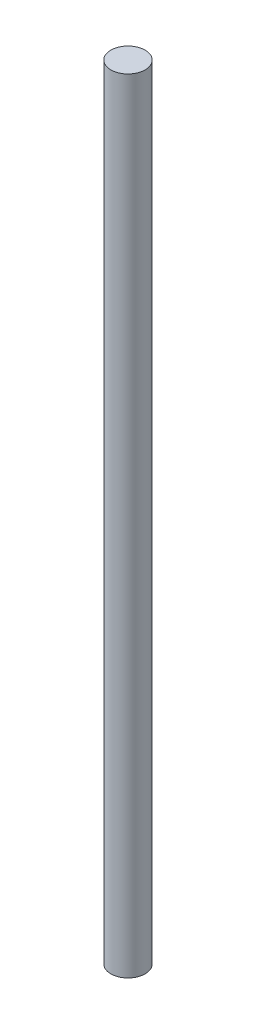
ISO-10303-21;
HEADER;
FILE_DESCRIPTION(('STEP AP214'),'2;1');
FILE_NAME('part.step','',(''),(''),'','','');
FILE_SCHEMA(('AUTOMOTIVE_DESIGN { 1 0 10303 214 1 1 1 1 }'));
ENDSEC;
DATA;
#1=APPLICATION_CONTEXT('core data for automotive mechanical design processes');
#2=APPLICATION_PROTOCOL_DEFINITION('international standard','automotive_design',2000,#1);
#3=PRODUCT_CONTEXT('',#1,'mechanical');
#4=PRODUCT('Part','Part','',(#3));
#5=PRODUCT_RELATED_PRODUCT_CATEGORY('part','',(#4));
#6=PRODUCT_DEFINITION_FORMATION('','',#4);
#7=PRODUCT_DEFINITION_CONTEXT('part definition',#1,'design');
#8=PRODUCT_DEFINITION('design','',#6,#7);
#9=PRODUCT_DEFINITION_SHAPE('','',#8);
#10=(LENGTH_UNIT() NAMED_UNIT(*) SI_UNIT(.MILLI.,.METRE.));
#11=(NAMED_UNIT(*) PLANE_ANGLE_UNIT() SI_UNIT($,.RADIAN.));
#12=(NAMED_UNIT(*) SI_UNIT($,.STERADIAN.) SOLID_ANGLE_UNIT());
#13=UNCERTAINTY_MEASURE_WITH_UNIT(LENGTH_MEASURE(1.E-05),#10,'distance_accuracy_value','');
#14=(GEOMETRIC_REPRESENTATION_CONTEXT(3) GLOBAL_UNCERTAINTY_ASSIGNED_CONTEXT((#13)) GLOBAL_UNIT_ASSIGNED_CONTEXT((#10,
#11,#12)) REPRESENTATION_CONTEXT('',''));
#15=CARTESIAN_POINT('',(0.,0.,0.));
#16=DIRECTION('',(0.,0.,1.));
#17=DIRECTION('',(1.,0.,0.));
#18=AXIS2_PLACEMENT_3D('',#15,#16,#17);
#19=CARTESIAN_POINT('',(0.,457.,0.));
#20=DIRECTION('',(0.,-1.,0.));
#21=DIRECTION('',(0.,0.,-1.));
#22=AXIS2_PLACEMENT_3D('',#19,#20,#21);
#23=CYLINDRICAL_SURFACE('',#22,10.);
#24=CARTESIAN_POINT('',(0.,457.,0.));
#25=DIRECTION('',(0.,1.,0.));
#26=DIRECTION('',(0.,0.,1.));
#27=AXIS2_PLACEMENT_3D('',#24,#25,#26);
#28=CIRCLE('',#27,10.);
#29=CARTESIAN_POINT('',(0.,457.,10.));
#30=VERTEX_POINT('',#29);
#31=EDGE_CURVE('E10',#30,#30,#28,.T.);
#32=ORIENTED_EDGE('',*,*,#31,.F.);
#33=EDGE_LOOP('',(#32));
#34=FACE_BOUND('',#33,.T.);
#35=CARTESIAN_POINT('',(0.,0.,0.));
#36=DIRECTION('',(0.,1.,0.));
#37=DIRECTION('',(0.,0.,1.));
#38=AXIS2_PLACEMENT_3D('',#35,#36,#37);
#39=CIRCLE('',#38,10.);
#40=CARTESIAN_POINT('',(0.,0.,10.));
#41=VERTEX_POINT('',#40);
#42=EDGE_CURVE('E38',#41,#41,#39,.T.);
#43=ORIENTED_EDGE('',*,*,#42,.T.);
#44=EDGE_LOOP('',(#43));
#45=FACE_BOUND('',#44,.T.);
#46=ADVANCED_FACE('F35',(#34,#45),#23,.T.);
#47=CARTESIAN_POINT('',(0.,457.,0.));
#48=DIRECTION('',(0.,1.,0.));
#49=DIRECTION('',(0.,0.,1.));
#50=AXIS2_PLACEMENT_3D('',#47,#48,#49);
#51=PLANE('',#50);
#52=ORIENTED_EDGE('',*,*,#31,.T.);
#53=EDGE_LOOP('',(#52));
#54=FACE_BOUND('',#53,.T.);
#55=ADVANCED_FACE('F50',(#54),#51,.T.);
#56=CARTESIAN_POINT('',(0.,0.,0.));
#57=DIRECTION('',(0.,1.,0.));
#58=DIRECTION('',(0.,0.,1.));
#59=AXIS2_PLACEMENT_3D('',#56,#57,#58);
#60=PLANE('',#59);
#61=ORIENTED_EDGE('',*,*,#42,.F.);
#62=EDGE_LOOP('',(#61));
#63=FACE_BOUND('',#62,.T.);
#64=ADVANCED_FACE('F48',(#63),#60,.F.);
#65=CLOSED_SHELL('',(#46,#55,#64));
#66=MANIFOLD_SOLID_BREP('B2',#65);
#67=ADVANCED_BREP_SHAPE_REPRESENTATION('',(#18,#66),#14);
#68=SHAPE_DEFINITION_REPRESENTATION(#9,#67);
ENDSEC;
END-ISO-10303-21;
